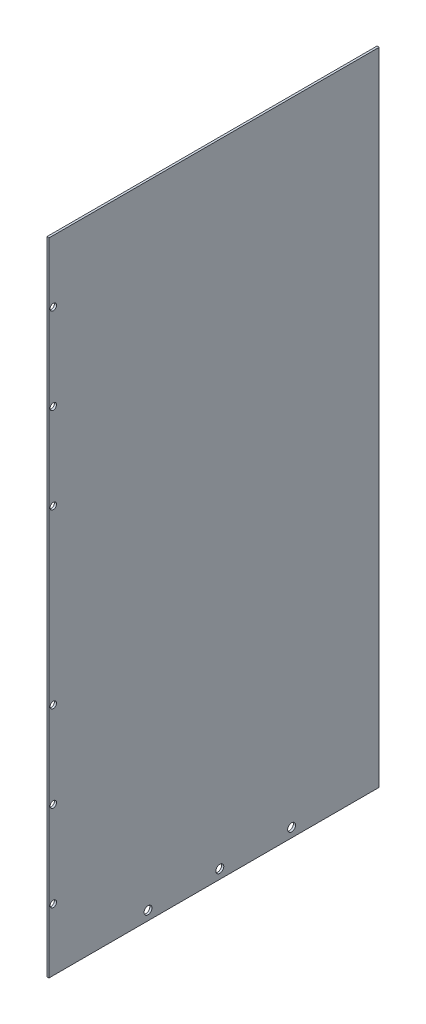
ISO-10303-21;
HEADER;
FILE_DESCRIPTION(('STEP AP214'),'2;1');
FILE_NAME('part.step','',(''),(''),'','','');
FILE_SCHEMA(('AUTOMOTIVE_DESIGN { 1 0 10303 214 1 1 1 1 }'));
ENDSEC;
DATA;
#1=APPLICATION_CONTEXT('core data for automotive mechanical design processes');
#2=APPLICATION_PROTOCOL_DEFINITION('international standard','automotive_design',2000,#1);
#3=PRODUCT_CONTEXT('',#1,'mechanical');
#4=PRODUCT('Part','Part','',(#3));
#5=PRODUCT_RELATED_PRODUCT_CATEGORY('part','',(#4));
#6=PRODUCT_DEFINITION_FORMATION('','',#4);
#7=PRODUCT_DEFINITION_CONTEXT('part definition',#1,'design');
#8=PRODUCT_DEFINITION('design','',#6,#7);
#9=PRODUCT_DEFINITION_SHAPE('','',#8);
#10=(LENGTH_UNIT() NAMED_UNIT(*) SI_UNIT(.MILLI.,.METRE.));
#11=(NAMED_UNIT(*) PLANE_ANGLE_UNIT() SI_UNIT($,.RADIAN.));
#12=(NAMED_UNIT(*) SI_UNIT($,.STERADIAN.) SOLID_ANGLE_UNIT());
#13=UNCERTAINTY_MEASURE_WITH_UNIT(LENGTH_MEASURE(1.E-05),#10,'distance_accuracy_value','');
#14=(GEOMETRIC_REPRESENTATION_CONTEXT(3) GLOBAL_UNCERTAINTY_ASSIGNED_CONTEXT((#13)) GLOBAL_UNIT_ASSIGNED_CONTEXT((#10,
#11,#12)) REPRESENTATION_CONTEXT('',''));
#15=CARTESIAN_POINT('',(0.,0.,0.));
#16=DIRECTION('',(0.,0.,1.));
#17=DIRECTION('',(1.,0.,0.));
#18=AXIS2_PLACEMENT_3D('',#15,#16,#17);
#19=CARTESIAN_POINT('',(1.5,0.,230.));
#20=DIRECTION('',(-1.,0.,0.));
#21=DIRECTION('',(0.,0.,1.));
#22=AXIS2_PLACEMENT_3D('',#19,#20,#21);
#23=PLANE('',#22);
#24=CARTESIAN_POINT('',(1.5,103.215,227.));
#25=DIRECTION('',(-1.,0.,0.));
#26=DIRECTION('',(0.,0.,1.));
#27=AXIS2_PLACEMENT_3D('',#24,#25,#26);
#28=CIRCLE('',#27,2.25000000000001);
#29=CARTESIAN_POINT('',(1.5,103.215,229.25));
#30=VERTEX_POINT('',#29);
#31=EDGE_CURVE('E322',#30,#30,#28,.T.);
#32=ORIENTED_EDGE('',*,*,#31,.T.);
#33=EDGE_LOOP('',(#32));
#34=FACE_BOUND('',#33,.T.);
#35=CARTESIAN_POINT('',(1.5,163.215,227.));
#36=DIRECTION('',(-1.,0.,0.));
#37=DIRECTION('',(0.,0.,1.));
#38=AXIS2_PLACEMENT_3D('',#35,#36,#37);
#39=CIRCLE('',#38,2.25000000000001);
#40=CARTESIAN_POINT('',(1.5,163.215,229.25));
#41=VERTEX_POINT('',#40);
#42=EDGE_CURVE('E324',#41,#41,#39,.T.);
#43=ORIENTED_EDGE('',*,*,#42,.T.);
#44=EDGE_LOOP('',(#43));
#45=FACE_BOUND('',#44,.T.);
#46=CARTESIAN_POINT('',(1.5,403.215,227.));
#47=DIRECTION('',(-1.,0.,0.));
#48=DIRECTION('',(0.,0.,1.));
#49=AXIS2_PLACEMENT_3D('',#46,#47,#48);
#50=CIRCLE('',#49,2.25000000000001);
#51=CARTESIAN_POINT('',(1.5,403.215,229.25));
#52=VERTEX_POINT('',#51);
#53=EDGE_CURVE('E328',#52,#52,#50,.T.);
#54=ORIENTED_EDGE('',*,*,#53,.T.);
#55=EDGE_LOOP('',(#54));
#56=FACE_BOUND('',#55,.T.);
#57=CARTESIAN_POINT('',(1.5,343.215,227.));
#58=DIRECTION('',(-1.,0.,0.));
#59=DIRECTION('',(0.,0.,1.));
#60=AXIS2_PLACEMENT_3D('',#57,#58,#59);
#61=CIRCLE('',#60,2.25000000000001);
#62=CARTESIAN_POINT('',(1.5,343.215,229.25));
#63=VERTEX_POINT('',#62);
#64=EDGE_CURVE('E333',#63,#63,#61,.T.);
#65=ORIENTED_EDGE('',*,*,#64,.T.);
#66=EDGE_LOOP('',(#65));
#67=FACE_BOUND('',#66,.T.);
#68=CARTESIAN_POINT('',(1.5,283.215,227.));
#69=DIRECTION('',(-1.,0.,0.));
#70=DIRECTION('',(0.,0.,1.));
#71=AXIS2_PLACEMENT_3D('',#68,#69,#70);
#72=CIRCLE('',#71,2.25000000000001);
#73=CARTESIAN_POINT('',(1.5,283.215,229.25));
#74=VERTEX_POINT('',#73);
#75=EDGE_CURVE('E336',#74,#74,#72,.T.);
#76=ORIENTED_EDGE('',*,*,#75,.T.);
#77=EDGE_LOOP('',(#76));
#78=FACE_BOUND('',#77,.T.);
#79=CARTESIAN_POINT('',(1.5,43.215,227.));
#80=DIRECTION('',(-1.,0.,0.));
#81=DIRECTION('',(0.,0.,1.));
#82=AXIS2_PLACEMENT_3D('',#79,#80,#81);
#83=CIRCLE('',#82,2.25000000000001);
#84=CARTESIAN_POINT('',(1.5,43.215,229.25));
#85=VERTEX_POINT('',#84);
#86=EDGE_CURVE('E129',#85,#85,#83,.T.);
#87=ORIENTED_EDGE('',*,*,#86,.T.);
#88=EDGE_LOOP('',(#87));
#89=FACE_BOUND('',#88,.T.);
#90=CARTESIAN_POINT('',(1.5,6.38169999999999,111.));
#91=DIRECTION('',(1.,0.,0.));
#92=DIRECTION('',(0.,0.,-1.));
#93=AXIS2_PLACEMENT_3D('',#90,#91,#92);
#94=CIRCLE('',#93,2.75000000000001);
#95=CARTESIAN_POINT('',(1.5,6.38169999999999,108.25));
#96=VERTEX_POINT('',#95);
#97=EDGE_CURVE('E119',#96,#96,#94,.T.);
#98=ORIENTED_EDGE('',*,*,#97,.F.);
#99=EDGE_LOOP('',(#98));
#100=FACE_BOUND('',#99,.T.);
#101=CARTESIAN_POINT('',(1.5,6.3817,61.));
#102=DIRECTION('',(1.,0.,0.));
#103=DIRECTION('',(0.,0.,-1.));
#104=AXIS2_PLACEMENT_3D('',#101,#102,#103);
#105=CIRCLE('',#104,2.75);
#106=CARTESIAN_POINT('',(1.5,6.3817,58.25));
#107=VERTEX_POINT('',#106);
#108=EDGE_CURVE('E124',#107,#107,#105,.T.);
#109=ORIENTED_EDGE('',*,*,#108,.F.);
#110=EDGE_LOOP('',(#109));
#111=FACE_BOUND('',#110,.T.);
#112=CARTESIAN_POINT('',(1.5,6.38169999999999,161.));
#113=DIRECTION('',(1.,0.,0.));
#114=DIRECTION('',(0.,0.,-1.));
#115=AXIS2_PLACEMENT_3D('',#112,#113,#114);
#116=CIRCLE('',#115,2.75000000000001);
#117=CARTESIAN_POINT('',(1.5,6.38169999999999,158.25));
#118=VERTEX_POINT('',#117);
#119=EDGE_CURVE('E116',#118,#118,#116,.T.);
#120=ORIENTED_EDGE('',*,*,#119,.F.);
#121=EDGE_LOOP('',(#120));
#122=FACE_BOUND('',#121,.T.);
#123=DIRECTION('',(0.,1.,0.));
#124=VECTOR('',#123,1.);
#125=CARTESIAN_POINT('',(1.5,0.,0.));
#126=LINE('',#125,#124);
#127=CARTESIAN_POINT('',(1.5,0.,0.));
#128=VERTEX_POINT('',#127);
#129=CARTESIAN_POINT('',(1.5,446.43,0.));
#130=VERTEX_POINT('',#129);
#131=EDGE_CURVE('E104',#128,#130,#126,.T.);
#132=ORIENTED_EDGE('',*,*,#131,.T.);
#133=DIRECTION('',(0.,0.,-1.));
#134=VECTOR('',#133,1.);
#135=CARTESIAN_POINT('',(1.5,446.43,230.));
#136=LINE('',#135,#134);
#137=CARTESIAN_POINT('',(1.5,446.43,230.));
#138=VERTEX_POINT('',#137);
#139=EDGE_CURVE('E11',#138,#130,#136,.T.);
#140=ORIENTED_EDGE('',*,*,#139,.F.);
#141=DIRECTION('',(0.,1.,0.));
#142=VECTOR('',#141,1.);
#143=CARTESIAN_POINT('',(1.5,0.,230.));
#144=LINE('',#143,#142);
#145=CARTESIAN_POINT('',(1.5,0.,230.));
#146=VERTEX_POINT('',#145);
#147=EDGE_CURVE('E80',#146,#138,#144,.T.);
#148=ORIENTED_EDGE('',*,*,#147,.F.);
#149=DIRECTION('',(0.,0.,-1.));
#150=VECTOR('',#149,1.);
#151=CARTESIAN_POINT('',(1.5,0.,230.));
#152=LINE('',#151,#150);
#153=EDGE_CURVE('E56',#146,#128,#152,.T.);
#154=ORIENTED_EDGE('',*,*,#153,.T.);
#155=EDGE_LOOP('',(#132,#140,#148,#154));
#156=FACE_BOUND('',#155,.T.);
#157=ADVANCED_FACE('F38',(#34,#45,#56,#67,#78,#89,#100,#111,#122,#156),#23,.F.);
#158=CARTESIAN_POINT('',(0.,446.43,230.));
#159=DIRECTION('',(0.,1.,0.));
#160=DIRECTION('',(0.,0.,1.));
#161=AXIS2_PLACEMENT_3D('',#158,#159,#160);
#162=PLANE('',#161);
#163=DIRECTION('',(1.,0.,0.));
#164=VECTOR('',#163,1.);
#165=CARTESIAN_POINT('',(0.,446.43,0.));
#166=LINE('',#165,#164);
#167=CARTESIAN_POINT('',(0.,446.43,0.));
#168=VERTEX_POINT('',#167);
#169=EDGE_CURVE('E89',#168,#130,#166,.T.);
#170=ORIENTED_EDGE('',*,*,#169,.F.);
#171=DIRECTION('',(0.,0.,-1.));
#172=VECTOR('',#171,1.);
#173=CARTESIAN_POINT('',(0.,446.43,230.));
#174=LINE('',#173,#172);
#175=CARTESIAN_POINT('',(0.,446.43,230.));
#176=VERTEX_POINT('',#175);
#177=EDGE_CURVE('E47',#176,#168,#174,.T.);
#178=ORIENTED_EDGE('',*,*,#177,.F.);
#179=DIRECTION('',(1.,0.,0.));
#180=VECTOR('',#179,1.);
#181=CARTESIAN_POINT('',(0.,446.43,230.));
#182=LINE('',#181,#180);
#183=EDGE_CURVE('E87',#176,#138,#182,.T.);
#184=ORIENTED_EDGE('',*,*,#183,.T.);
#185=ORIENTED_EDGE('',*,*,#139,.T.);
#186=EDGE_LOOP('',(#170,#178,#184,#185));
#187=FACE_BOUND('',#186,.T.);
#188=ADVANCED_FACE('F86',(#187),#162,.T.);
#189=CARTESIAN_POINT('',(0.,0.,230.));
#190=DIRECTION('',(-1.,0.,0.));
#191=DIRECTION('',(0.,0.,1.));
#192=AXIS2_PLACEMENT_3D('',#189,#190,#191);
#193=PLANE('',#192);
#194=CARTESIAN_POINT('',(0.,103.215,227.));
#195=DIRECTION('',(-1.,0.,0.));
#196=DIRECTION('',(0.,0.,1.));
#197=AXIS2_PLACEMENT_3D('',#194,#195,#196);
#198=CIRCLE('',#197,2.25000000000001);
#199=CARTESIAN_POINT('',(0.,103.215,229.25));
#200=VERTEX_POINT('',#199);
#201=EDGE_CURVE('E319',#200,#200,#198,.T.);
#202=ORIENTED_EDGE('',*,*,#201,.F.);
#203=EDGE_LOOP('',(#202));
#204=FACE_BOUND('',#203,.T.);
#205=CARTESIAN_POINT('',(0.,163.215,227.));
#206=DIRECTION('',(-1.,0.,0.));
#207=DIRECTION('',(0.,0.,1.));
#208=AXIS2_PLACEMENT_3D('',#205,#206,#207);
#209=CIRCLE('',#208,2.25000000000001);
#210=CARTESIAN_POINT('',(0.,163.215,229.25));
#211=VERTEX_POINT('',#210);
#212=EDGE_CURVE('E348',#211,#211,#209,.T.);
#213=ORIENTED_EDGE('',*,*,#212,.F.);
#214=EDGE_LOOP('',(#213));
#215=FACE_BOUND('',#214,.T.);
#216=CARTESIAN_POINT('',(0.,403.215,227.));
#217=DIRECTION('',(-1.,0.,0.));
#218=DIRECTION('',(0.,0.,-1.));
#219=AXIS2_PLACEMENT_3D('',#216,#217,#218);
#220=CIRCLE('',#219,2.25000000000001);
#221=CARTESIAN_POINT('',(0.,403.215,224.75));
#222=VERTEX_POINT('',#221);
#223=EDGE_CURVE('E345',#222,#222,#220,.T.);
#224=ORIENTED_EDGE('',*,*,#223,.F.);
#225=EDGE_LOOP('',(#224));
#226=FACE_BOUND('',#225,.T.);
#227=CARTESIAN_POINT('',(0.,343.215,227.));
#228=DIRECTION('',(-1.,0.,0.));
#229=DIRECTION('',(0.,0.,-1.));
#230=AXIS2_PLACEMENT_3D('',#227,#228,#229);
#231=CIRCLE('',#230,2.25000000000001);
#232=CARTESIAN_POINT('',(0.,343.215,224.75));
#233=VERTEX_POINT('',#232);
#234=EDGE_CURVE('E342',#233,#233,#231,.T.);
#235=ORIENTED_EDGE('',*,*,#234,.F.);
#236=EDGE_LOOP('',(#235));
#237=FACE_BOUND('',#236,.T.);
#238=CARTESIAN_POINT('',(0.,283.215,227.));
#239=DIRECTION('',(-1.,0.,0.));
#240=DIRECTION('',(0.,0.,-1.));
#241=AXIS2_PLACEMENT_3D('',#238,#239,#240);
#242=CIRCLE('',#241,2.25000000000001);
#243=CARTESIAN_POINT('',(0.,283.215,224.75));
#244=VERTEX_POINT('',#243);
#245=EDGE_CURVE('E339',#244,#244,#242,.T.);
#246=ORIENTED_EDGE('',*,*,#245,.F.);
#247=EDGE_LOOP('',(#246));
#248=FACE_BOUND('',#247,.T.);
#249=CARTESIAN_POINT('',(0.,43.215,227.));
#250=DIRECTION('',(-1.,0.,0.));
#251=DIRECTION('',(0.,0.,1.));
#252=AXIS2_PLACEMENT_3D('',#249,#250,#251);
#253=CIRCLE('',#252,2.25000000000001);
#254=CARTESIAN_POINT('',(0.,43.215,229.25));
#255=VERTEX_POINT('',#254);
#256=EDGE_CURVE('E323',#255,#255,#253,.T.);
#257=ORIENTED_EDGE('',*,*,#256,.F.);
#258=EDGE_LOOP('',(#257));
#259=FACE_BOUND('',#258,.T.);
#260=CARTESIAN_POINT('',(0.,6.38169999999999,111.));
#261=DIRECTION('',(-1.,0.,0.));
#262=DIRECTION('',(0.,0.,1.));
#263=AXIS2_PLACEMENT_3D('',#260,#261,#262);
#264=CIRCLE('',#263,2.75000000000001);
#265=CARTESIAN_POINT('',(0.,6.38169999999999,113.75));
#266=VERTEX_POINT('',#265);
#267=EDGE_CURVE('E41',#266,#266,#264,.T.);
#268=ORIENTED_EDGE('',*,*,#267,.F.);
#269=EDGE_LOOP('',(#268));
#270=FACE_BOUND('',#269,.T.);
#271=CARTESIAN_POINT('',(0.,6.3817,61.));
#272=DIRECTION('',(-1.,0.,0.));
#273=DIRECTION('',(0.,0.,1.));
#274=AXIS2_PLACEMENT_3D('',#271,#272,#273);
#275=CIRCLE('',#274,2.75);
#276=CARTESIAN_POINT('',(0.,6.3817,63.75));
#277=VERTEX_POINT('',#276);
#278=EDGE_CURVE('E117',#277,#277,#275,.T.);
#279=ORIENTED_EDGE('',*,*,#278,.F.);
#280=EDGE_LOOP('',(#279));
#281=FACE_BOUND('',#280,.T.);
#282=CARTESIAN_POINT('',(0.,6.38169999999999,161.));
#283=DIRECTION('',(-1.,0.,0.));
#284=DIRECTION('',(0.,0.,1.));
#285=AXIS2_PLACEMENT_3D('',#282,#283,#284);
#286=CIRCLE('',#285,2.75000000000001);
#287=CARTESIAN_POINT('',(0.,6.38169999999999,163.75));
#288=VERTEX_POINT('',#287);
#289=EDGE_CURVE('E106',#288,#288,#286,.T.);
#290=ORIENTED_EDGE('',*,*,#289,.F.);
#291=EDGE_LOOP('',(#290));
#292=FACE_BOUND('',#291,.T.);
#293=DIRECTION('',(0.,1.,0.));
#294=VECTOR('',#293,1.);
#295=CARTESIAN_POINT('',(0.,0.,0.));
#296=LINE('',#295,#294);
#297=CARTESIAN_POINT('',(0.,0.,0.));
#298=VERTEX_POINT('',#297);
#299=EDGE_CURVE('E108',#298,#168,#296,.T.);
#300=ORIENTED_EDGE('',*,*,#299,.F.);
#301=DIRECTION('',(0.,0.,-1.));
#302=VECTOR('',#301,1.);
#303=CARTESIAN_POINT('',(0.,0.,230.));
#304=LINE('',#303,#302);
#305=CARTESIAN_POINT('',(0.,0.,230.));
#306=VERTEX_POINT('',#305);
#307=EDGE_CURVE('E69',#306,#298,#304,.T.);
#308=ORIENTED_EDGE('',*,*,#307,.F.);
#309=DIRECTION('',(0.,1.,0.));
#310=VECTOR('',#309,1.);
#311=CARTESIAN_POINT('',(0.,0.,230.));
#312=LINE('',#311,#310);
#313=EDGE_CURVE('E96',#306,#176,#312,.T.);
#314=ORIENTED_EDGE('',*,*,#313,.T.);
#315=ORIENTED_EDGE('',*,*,#177,.T.);
#316=EDGE_LOOP('',(#300,#308,#314,#315));
#317=FACE_BOUND('',#316,.T.);
#318=ADVANCED_FACE('F98',(#204,#215,#226,#237,#248,#259,#270,#281,#292,#317),#193,.T.);
#319=CARTESIAN_POINT('',(1.5,0.,230.));
#320=DIRECTION('',(0.,-1.,0.));
#321=DIRECTION('',(0.,0.,-1.));
#322=AXIS2_PLACEMENT_3D('',#319,#320,#321);
#323=PLANE('',#322);
#324=DIRECTION('',(-1.,0.,0.));
#325=VECTOR('',#324,1.);
#326=CARTESIAN_POINT('',(1.5,0.,0.));
#327=LINE('',#326,#325);
#328=EDGE_CURVE('E110',#128,#298,#327,.T.);
#329=ORIENTED_EDGE('',*,*,#328,.F.);
#330=ORIENTED_EDGE('',*,*,#153,.F.);
#331=DIRECTION('',(-1.,0.,0.));
#332=VECTOR('',#331,1.);
#333=CARTESIAN_POINT('',(1.5,0.,230.));
#334=LINE('',#333,#332);
#335=EDGE_CURVE('E99',#146,#306,#334,.T.);
#336=ORIENTED_EDGE('',*,*,#335,.T.);
#337=ORIENTED_EDGE('',*,*,#307,.T.);
#338=EDGE_LOOP('',(#329,#330,#336,#337));
#339=FACE_BOUND('',#338,.T.);
#340=ADVANCED_FACE('F143',(#339),#323,.T.);
#341=CARTESIAN_POINT('',(0.,0.,230.));
#342=DIRECTION('',(0.,0.,-1.));
#343=DIRECTION('',(-1.,0.,0.));
#344=AXIS2_PLACEMENT_3D('',#341,#342,#343);
#345=PLANE('',#344);
#346=ORIENTED_EDGE('',*,*,#147,.T.);
#347=ORIENTED_EDGE('',*,*,#183,.F.);
#348=ORIENTED_EDGE('',*,*,#313,.F.);
#349=ORIENTED_EDGE('',*,*,#335,.F.);
#350=EDGE_LOOP('',(#346,#347,#348,#349));
#351=FACE_BOUND('',#350,.T.);
#352=ADVANCED_FACE('F95',(#351),#345,.F.);
#353=CARTESIAN_POINT('',(0.,0.,0.));
#354=DIRECTION('',(0.,0.,-1.));
#355=DIRECTION('',(-1.,0.,0.));
#356=AXIS2_PLACEMENT_3D('',#353,#354,#355);
#357=PLANE('',#356);
#358=ORIENTED_EDGE('',*,*,#131,.F.);
#359=ORIENTED_EDGE('',*,*,#328,.T.);
#360=ORIENTED_EDGE('',*,*,#299,.T.);
#361=ORIENTED_EDGE('',*,*,#169,.T.);
#362=EDGE_LOOP('',(#358,#359,#360,#361));
#363=FACE_BOUND('',#362,.T.);
#364=ADVANCED_FACE('F142',(#363),#357,.T.);
#365=CARTESIAN_POINT('',(-18.5,6.38169999999999,161.));
#366=DIRECTION('',(1.,0.,0.));
#367=DIRECTION('',(0.,0.,-1.));
#368=AXIS2_PLACEMENT_3D('',#365,#366,#367);
#369=CYLINDRICAL_SURFACE('',#368,2.75000000000001);
#370=ORIENTED_EDGE('',*,*,#289,.T.);
#371=EDGE_LOOP('',(#370));
#372=FACE_BOUND('',#371,.T.);
#373=ORIENTED_EDGE('',*,*,#119,.T.);
#374=EDGE_LOOP('',(#373));
#375=FACE_BOUND('',#374,.T.);
#376=ADVANCED_FACE('F137',(#372,#375),#369,.F.);
#377=CARTESIAN_POINT('',(-18.5,6.3817,61.));
#378=DIRECTION('',(1.,0.,0.));
#379=DIRECTION('',(0.,0.,-1.));
#380=AXIS2_PLACEMENT_3D('',#377,#378,#379);
#381=CYLINDRICAL_SURFACE('',#380,2.75);
#382=ORIENTED_EDGE('',*,*,#278,.T.);
#383=EDGE_LOOP('',(#382));
#384=FACE_BOUND('',#383,.T.);
#385=ORIENTED_EDGE('',*,*,#108,.T.);
#386=EDGE_LOOP('',(#385));
#387=FACE_BOUND('',#386,.T.);
#388=ADVANCED_FACE('F250',(#384,#387),#381,.F.);
#389=CARTESIAN_POINT('',(-18.5,6.38169999999999,111.));
#390=DIRECTION('',(1.,0.,0.));
#391=DIRECTION('',(0.,0.,-1.));
#392=AXIS2_PLACEMENT_3D('',#389,#390,#391);
#393=CYLINDRICAL_SURFACE('',#392,2.75000000000001);
#394=ORIENTED_EDGE('',*,*,#267,.T.);
#395=EDGE_LOOP('',(#394));
#396=FACE_BOUND('',#395,.T.);
#397=ORIENTED_EDGE('',*,*,#97,.T.);
#398=EDGE_LOOP('',(#397));
#399=FACE_BOUND('',#398,.T.);
#400=ADVANCED_FACE('F179',(#396,#399),#393,.F.);
#401=CARTESIAN_POINT('',(10.,43.215,227.));
#402=DIRECTION('',(-1.,0.,0.));
#403=DIRECTION('',(0.,0.,1.));
#404=AXIS2_PLACEMENT_3D('',#401,#402,#403);
#405=CYLINDRICAL_SURFACE('',#404,2.25000000000001);
#406=ORIENTED_EDGE('',*,*,#256,.T.);
#407=EDGE_LOOP('',(#406));
#408=FACE_BOUND('',#407,.T.);
#409=ORIENTED_EDGE('',*,*,#86,.F.);
#410=EDGE_LOOP('',(#409));
#411=FACE_BOUND('',#410,.T.);
#412=ADVANCED_FACE('F173',(#408,#411),#405,.F.);
#413=CARTESIAN_POINT('',(10.,283.215,227.));
#414=DIRECTION('',(-1.,0.,0.));
#415=DIRECTION('',(0.,0.,1.));
#416=AXIS2_PLACEMENT_3D('',#413,#414,#415);
#417=CYLINDRICAL_SURFACE('',#416,2.25000000000001);
#418=ORIENTED_EDGE('',*,*,#245,.T.);
#419=EDGE_LOOP('',(#418));
#420=FACE_BOUND('',#419,.T.);
#421=ORIENTED_EDGE('',*,*,#75,.F.);
#422=EDGE_LOOP('',(#421));
#423=FACE_BOUND('',#422,.T.);
#424=ADVANCED_FACE('F178',(#420,#423),#417,.F.);
#425=CARTESIAN_POINT('',(10.,343.215,227.));
#426=DIRECTION('',(-1.,0.,0.));
#427=DIRECTION('',(0.,0.,1.));
#428=AXIS2_PLACEMENT_3D('',#425,#426,#427);
#429=CYLINDRICAL_SURFACE('',#428,2.25000000000001);
#430=ORIENTED_EDGE('',*,*,#234,.T.);
#431=EDGE_LOOP('',(#430));
#432=FACE_BOUND('',#431,.T.);
#433=ORIENTED_EDGE('',*,*,#64,.F.);
#434=EDGE_LOOP('',(#433));
#435=FACE_BOUND('',#434,.T.);
#436=ADVANCED_FACE('F192',(#432,#435),#429,.F.);
#437=CARTESIAN_POINT('',(10.,403.215,227.));
#438=DIRECTION('',(-1.,0.,0.));
#439=DIRECTION('',(0.,0.,1.));
#440=AXIS2_PLACEMENT_3D('',#437,#438,#439);
#441=CYLINDRICAL_SURFACE('',#440,2.25000000000001);
#442=ORIENTED_EDGE('',*,*,#223,.T.);
#443=EDGE_LOOP('',(#442));
#444=FACE_BOUND('',#443,.T.);
#445=ORIENTED_EDGE('',*,*,#53,.F.);
#446=EDGE_LOOP('',(#445));
#447=FACE_BOUND('',#446,.T.);
#448=ADVANCED_FACE('F203',(#444,#447),#441,.F.);
#449=CARTESIAN_POINT('',(10.,163.215,227.));
#450=DIRECTION('',(-1.,0.,0.));
#451=DIRECTION('',(0.,0.,1.));
#452=AXIS2_PLACEMENT_3D('',#449,#450,#451);
#453=CYLINDRICAL_SURFACE('',#452,2.25000000000001);
#454=ORIENTED_EDGE('',*,*,#212,.T.);
#455=EDGE_LOOP('',(#454));
#456=FACE_BOUND('',#455,.T.);
#457=ORIENTED_EDGE('',*,*,#42,.F.);
#458=EDGE_LOOP('',(#457));
#459=FACE_BOUND('',#458,.T.);
#460=ADVANCED_FACE('F214',(#456,#459),#453,.F.);
#461=CARTESIAN_POINT('',(10.,103.215,227.));
#462=DIRECTION('',(-1.,0.,0.));
#463=DIRECTION('',(0.,0.,1.));
#464=AXIS2_PLACEMENT_3D('',#461,#462,#463);
#465=CYLINDRICAL_SURFACE('',#464,2.25000000000001);
#466=ORIENTED_EDGE('',*,*,#201,.T.);
#467=EDGE_LOOP('',(#466));
#468=FACE_BOUND('',#467,.T.);
#469=ORIENTED_EDGE('',*,*,#31,.F.);
#470=EDGE_LOOP('',(#469));
#471=FACE_BOUND('',#470,.T.);
#472=ADVANCED_FACE('F225',(#468,#471),#465,.F.);
#473=CLOSED_SHELL('',(#157,#188,#318,#340,#352,#364,#376,#388,#400,#412,#424,#436,#448,#460,#472));
#474=MANIFOLD_SOLID_BREP('B2',#473);
#475=ADVANCED_BREP_SHAPE_REPRESENTATION('',(#18,#474),#14);
#476=SHAPE_DEFINITION_REPRESENTATION(#9,#475);
ENDSEC;
END-ISO-10303-21;
